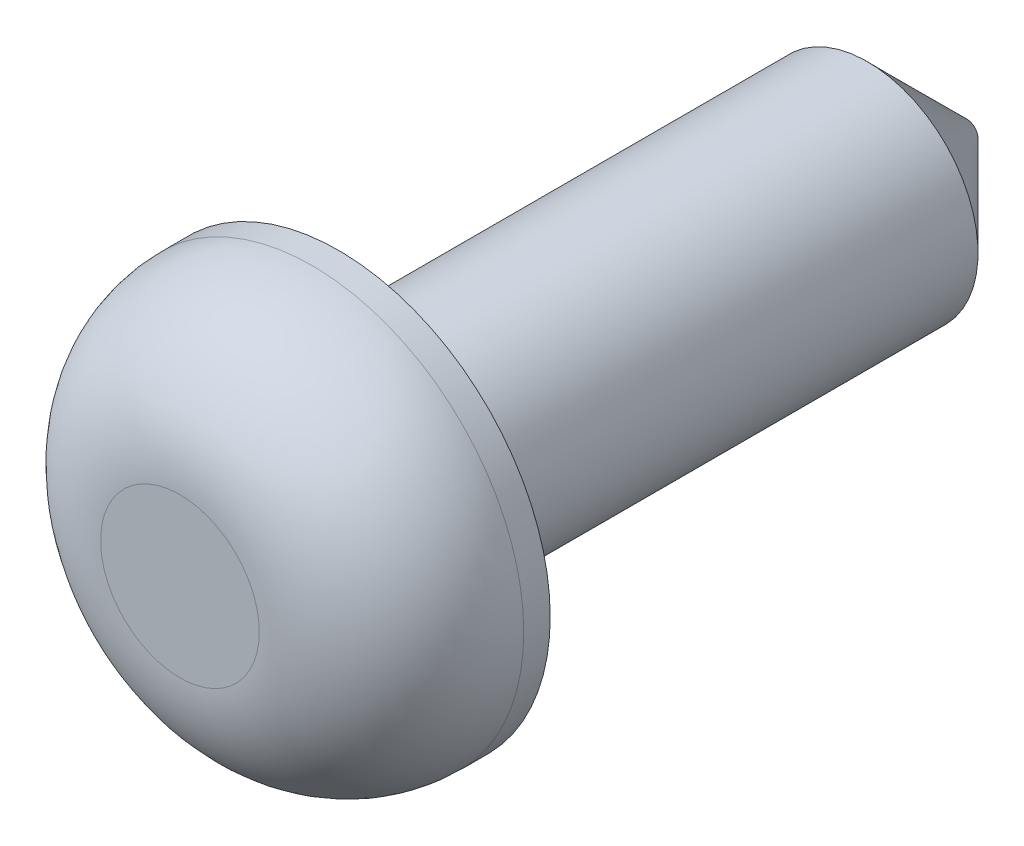
ISO-10303-21;
HEADER;
FILE_DESCRIPTION(('STEP AP214'),'2;1');
FILE_NAME('part.step','',(''),(''),'','','');
FILE_SCHEMA(('AUTOMOTIVE_DESIGN { 1 0 10303 214 1 1 1 1 }'));
ENDSEC;
DATA;
#1=APPLICATION_CONTEXT('core data for automotive mechanical design processes');
#2=APPLICATION_PROTOCOL_DEFINITION('international standard','automotive_design',2000,#1);
#3=PRODUCT_CONTEXT('',#1,'mechanical');
#4=PRODUCT('Part','Part','',(#3));
#5=PRODUCT_RELATED_PRODUCT_CATEGORY('part','',(#4));
#6=PRODUCT_DEFINITION_FORMATION('','',#4);
#7=PRODUCT_DEFINITION_CONTEXT('part definition',#1,'design');
#8=PRODUCT_DEFINITION('design','',#6,#7);
#9=PRODUCT_DEFINITION_SHAPE('','',#8);
#10=(LENGTH_UNIT() NAMED_UNIT(*) SI_UNIT(.MILLI.,.METRE.));
#11=(NAMED_UNIT(*) PLANE_ANGLE_UNIT() SI_UNIT($,.RADIAN.));
#12=(NAMED_UNIT(*) SI_UNIT($,.STERADIAN.) SOLID_ANGLE_UNIT());
#13=UNCERTAINTY_MEASURE_WITH_UNIT(LENGTH_MEASURE(1.E-05),#10,'distance_accuracy_value','');
#14=(GEOMETRIC_REPRESENTATION_CONTEXT(3) GLOBAL_UNCERTAINTY_ASSIGNED_CONTEXT((#13)) GLOBAL_UNIT_ASSIGNED_CONTEXT((#10,
#11,#12)) REPRESENTATION_CONTEXT('',''));
#15=CARTESIAN_POINT('',(0.,0.,0.));
#16=DIRECTION('',(0.,0.,1.));
#17=DIRECTION('',(1.,0.,0.));
#18=AXIS2_PLACEMENT_3D('',#15,#16,#17);
#19=CARTESIAN_POINT('',(0.,0.,3.048));
#20=DIRECTION('',(0.,0.,-1.));
#21=DIRECTION('',(-1.,0.,0.));
#22=AXIS2_PLACEMENT_3D('',#19,#20,#21);
#23=CYLINDRICAL_SURFACE('',#22,4.064);
#24=CARTESIAN_POINT('',(0.,0.,0.507999999999998));
#25=DIRECTION('',(0.,0.,1.));
#26=DIRECTION('',(1.,0.,0.));
#27=AXIS2_PLACEMENT_3D('',#24,#25,#26);
#28=CIRCLE('',#27,4.064);
#29=CARTESIAN_POINT('',(4.064,0.,0.507999999999998));
#30=VERTEX_POINT('',#29);
#31=EDGE_CURVE('E10',#30,#30,#28,.F.);
#32=ORIENTED_EDGE('',*,*,#31,.T.);
#33=EDGE_LOOP('',(#32));
#34=FACE_BOUND('',#33,.T.);
#35=CARTESIAN_POINT('',(0.,0.,0.));
#36=DIRECTION('',(0.,0.,1.));
#37=DIRECTION('',(1.,0.,0.));
#38=AXIS2_PLACEMENT_3D('',#35,#36,#37);
#39=CIRCLE('',#38,4.064);
#40=CARTESIAN_POINT('',(4.064,0.,0.));
#41=VERTEX_POINT('',#40);
#42=EDGE_CURVE('E61',#41,#41,#39,.T.);
#43=ORIENTED_EDGE('',*,*,#42,.T.);
#44=EDGE_LOOP('',(#43));
#45=FACE_BOUND('',#44,.T.);
#46=ADVANCED_FACE('F38',(#34,#45),#23,.T.);
#47=CARTESIAN_POINT('',(0.,0.,3.048));
#48=DIRECTION('',(0.,0.,1.));
#49=DIRECTION('',(1.,0.,0.));
#50=AXIS2_PLACEMENT_3D('',#47,#48,#49);
#51=PLANE('',#50);
#52=CARTESIAN_POINT('',(0.,0.,3.048));
#53=DIRECTION('',(0.,0.,1.));
#54=DIRECTION('',(1.,0.,0.));
#55=AXIS2_PLACEMENT_3D('',#52,#53,#54);
#56=CIRCLE('',#55,1.524);
#57=CARTESIAN_POINT('',(1.524,0.,3.048));
#58=VERTEX_POINT('',#57);
#59=EDGE_CURVE('E45',#58,#58,#56,.T.);
#60=ORIENTED_EDGE('',*,*,#59,.T.);
#61=EDGE_LOOP('',(#60));
#62=FACE_BOUND('',#61,.T.);
#63=ADVANCED_FACE('F72',(#62),#51,.T.);
#64=CARTESIAN_POINT('',(0.,0.,0.));
#65=DIRECTION('',(0.,0.,1.));
#66=DIRECTION('',(1.,0.,0.));
#67=AXIS2_PLACEMENT_3D('',#64,#65,#66);
#68=PLANE('',#67);
#69=CARTESIAN_POINT('',(0.,0.,0.));
#70=DIRECTION('',(0.,0.,-1.));
#71=DIRECTION('',(-1.,0.,0.));
#72=AXIS2_PLACEMENT_3D('',#69,#70,#71);
#73=CIRCLE('',#72,2.1209);
#74=CARTESIAN_POINT('',(-2.1209,0.,0.));
#75=VERTEX_POINT('',#74);
#76=EDGE_CURVE('E60',#75,#75,#73,.T.);
#77=ORIENTED_EDGE('',*,*,#76,.F.);
#78=EDGE_LOOP('',(#77));
#79=FACE_BOUND('',#78,.T.);
#80=ORIENTED_EDGE('',*,*,#42,.F.);
#81=EDGE_LOOP('',(#80));
#82=FACE_BOUND('',#81,.T.);
#83=ADVANCED_FACE('F69',(#79,#82),#68,.F.);
#84=CARTESIAN_POINT('',(0.,0.,-12.065));
#85=DIRECTION('',(0.,0.,1.));
#86=DIRECTION('',(1.,0.,0.));
#87=AXIS2_PLACEMENT_3D('',#84,#85,#86);
#88=CYLINDRICAL_SURFACE('',#87,2.1209);
#89=CARTESIAN_POINT('',(0.,0.,-10.16));
#90=DIRECTION('',(0.,0.,-1.));
#91=DIRECTION('',(-1.,0.,0.));
#92=AXIS2_PLACEMENT_3D('',#89,#90,#91);
#93=CIRCLE('',#92,2.1209);
#94=CARTESIAN_POINT('',(-2.1209,0.,-10.16));
#95=VERTEX_POINT('',#94);
#96=EDGE_CURVE('E49',#95,#95,#93,.F.);
#97=ORIENTED_EDGE('',*,*,#96,.T.);
#98=EDGE_LOOP('',(#97));
#99=FACE_BOUND('',#98,.T.);
#100=ORIENTED_EDGE('',*,*,#76,.T.);
#101=EDGE_LOOP('',(#100));
#102=FACE_BOUND('',#101,.T.);
#103=ADVANCED_FACE('F67',(#99,#102),#88,.T.);
#104=CARTESIAN_POINT('',(0.,0.,-12.065));
#105=DIRECTION('',(0.,0.,-1.));
#106=DIRECTION('',(-1.,0.,0.));
#107=AXIS2_PLACEMENT_3D('',#104,#105,#106);
#108=PLANE('',#107);
#109=CARTESIAN_POINT('',(0.,0.,-12.065));
#110=DIRECTION('',(0.,0.,-1.));
#111=DIRECTION('',(-1.,0.,0.));
#112=AXIS2_PLACEMENT_3D('',#109,#110,#111);
#113=CIRCLE('',#112,0.215899999999999);
#114=CARTESIAN_POINT('',(-0.215899999999999,0.,-12.065));
#115=VERTEX_POINT('',#114);
#116=EDGE_CURVE('E54',#115,#115,#113,.T.);
#117=ORIENTED_EDGE('',*,*,#116,.T.);
#118=EDGE_LOOP('',(#117));
#119=FACE_BOUND('',#118,.T.);
#120=ADVANCED_FACE('F87',(#119),#108,.T.);
#121=CARTESIAN_POINT('',(0.,0.,-12.065));
#122=DIRECTION('',(0.,0.,1.));
#123=DIRECTION('',(1.,0.,0.));
#124=AXIS2_PLACEMENT_3D('',#121,#122,#123);
#125=CONICAL_SURFACE('',#124,0.215899999999999,0.785398163397447);
#126=ORIENTED_EDGE('',*,*,#96,.F.);
#127=EDGE_LOOP('',(#126));
#128=FACE_BOUND('',#127,.T.);
#129=ORIENTED_EDGE('',*,*,#116,.F.);
#130=EDGE_LOOP('',(#129));
#131=FACE_BOUND('',#130,.T.);
#132=ADVANCED_FACE('F83',(#128,#131),#125,.T.);
#133=CARTESIAN_POINT('',(0.,0.,0.508));
#134=DIRECTION('',(0.,0.,1.));
#135=DIRECTION('',(1.,0.,0.));
#136=AXIS2_PLACEMENT_3D('',#133,#134,#135);
#137=DEGENERATE_TOROIDAL_SURFACE('',#136,1.524,2.54,.T.);
#138=ORIENTED_EDGE('',*,*,#31,.F.);
#139=EDGE_LOOP('',(#138));
#140=FACE_BOUND('',#139,.T.);
#141=ORIENTED_EDGE('',*,*,#59,.F.);
#142=EDGE_LOOP('',(#141));
#143=FACE_BOUND('',#142,.T.);
#144=ADVANCED_FACE('F40',(#140,#143),#137,.T.);
#145=CLOSED_SHELL('',(#46,#63,#83,#103,#120,#132,#144));
#146=MANIFOLD_SOLID_BREP('B2',#145);
#147=ADVANCED_BREP_SHAPE_REPRESENTATION('',(#18,#146),#14);
#148=SHAPE_DEFINITION_REPRESENTATION(#9,#147);
ENDSEC;
END-ISO-10303-21;
